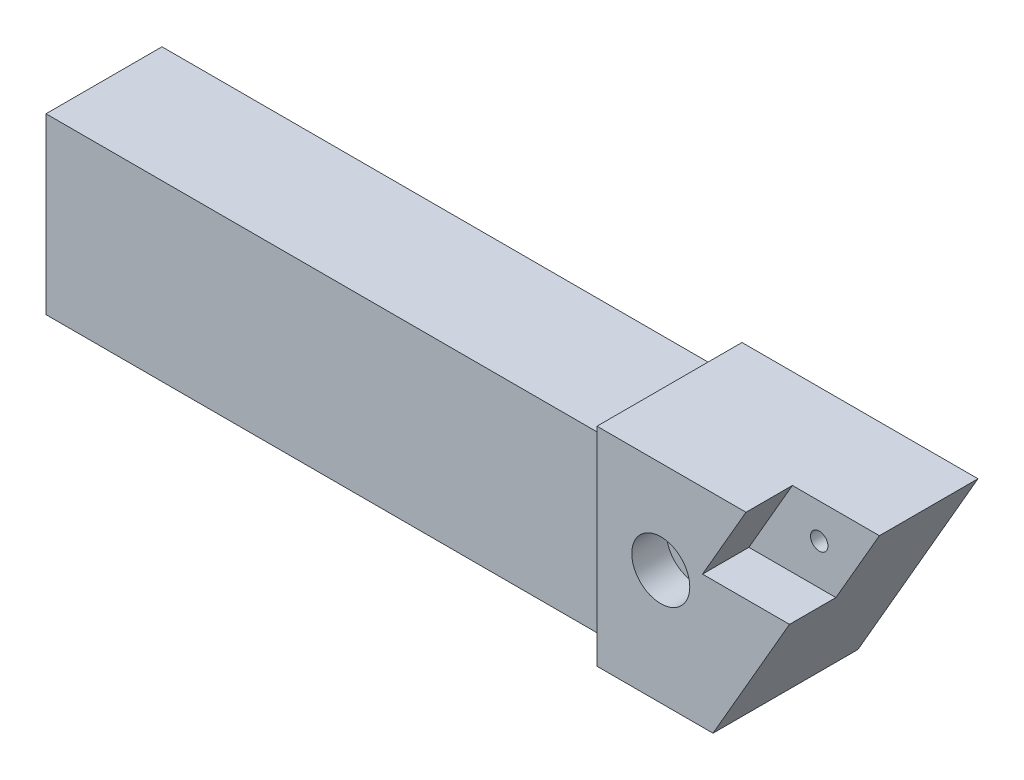
ISO-10303-21;
HEADER;
FILE_DESCRIPTION(('STEP AP214'),'2;1');
FILE_NAME('part.step','',(''),(''),'','','');
FILE_SCHEMA(('AUTOMOTIVE_DESIGN { 1 0 10303 214 1 1 1 1 }'));
ENDSEC;
DATA;
#1=APPLICATION_CONTEXT('core data for automotive mechanical design processes');
#2=APPLICATION_PROTOCOL_DEFINITION('international standard','automotive_design',2000,#1);
#3=PRODUCT_CONTEXT('',#1,'mechanical');
#4=PRODUCT('Part','Part','',(#3));
#5=PRODUCT_RELATED_PRODUCT_CATEGORY('part','',(#4));
#6=PRODUCT_DEFINITION_FORMATION('','',#4);
#7=PRODUCT_DEFINITION_CONTEXT('part definition',#1,'design');
#8=PRODUCT_DEFINITION('design','',#6,#7);
#9=PRODUCT_DEFINITION_SHAPE('','',#8);
#10=(LENGTH_UNIT() NAMED_UNIT(*) SI_UNIT(.MILLI.,.METRE.));
#11=(NAMED_UNIT(*) PLANE_ANGLE_UNIT() SI_UNIT($,.RADIAN.));
#12=(NAMED_UNIT(*) SI_UNIT($,.STERADIAN.) SOLID_ANGLE_UNIT());
#13=UNCERTAINTY_MEASURE_WITH_UNIT(LENGTH_MEASURE(1.E-05),#10,'distance_accuracy_value','');
#14=(GEOMETRIC_REPRESENTATION_CONTEXT(3) GLOBAL_UNCERTAINTY_ASSIGNED_CONTEXT((#13)) GLOBAL_UNIT_ASSIGNED_CONTEXT((#10,
#11,#12)) REPRESENTATION_CONTEXT('',''));
#15=CARTESIAN_POINT('',(0.,0.,0.));
#16=DIRECTION('',(0.,0.,1.));
#17=DIRECTION('',(1.,0.,0.));
#18=AXIS2_PLACEMENT_3D('',#15,#16,#17);
#19=CARTESIAN_POINT('',(-50.,15.,20.));
#20=DIRECTION('',(0.,-1.,0.));
#21=DIRECTION('',(0.,0.,-1.));
#22=AXIS2_PLACEMENT_3D('',#19,#20,#21);
#23=PLANE('',#22);
#24=DIRECTION('',(-1.,0.,0.));
#25=VECTOR('',#24,1.);
#26=CARTESIAN_POINT('',(-50.,15.,20.));
#27=LINE('',#26,#25);
#28=CARTESIAN_POINT('',(45.,15.,20.));
#29=VERTEX_POINT('',#28);
#30=CARTESIAN_POINT('',(-50.,15.,20.));
#31=VERTEX_POINT('',#30);
#32=EDGE_CURVE('E162',#29,#31,#27,.T.);
#33=ORIENTED_EDGE('',*,*,#32,.F.);
#34=DIRECTION('',(0.,0.,-1.));
#35=VECTOR('',#34,1.);
#36=CARTESIAN_POINT('',(45.,15.,20.));
#37=LINE('',#36,#35);
#38=CARTESIAN_POINT('',(45.,15.,0.));
#39=VERTEX_POINT('',#38);
#40=EDGE_CURVE('E186',#29,#39,#37,.T.);
#41=ORIENTED_EDGE('',*,*,#40,.T.);
#42=DIRECTION('',(-1.,0.,0.));
#43=VECTOR('',#42,1.);
#44=CARTESIAN_POINT('',(-50.,15.,0.));
#45=LINE('',#44,#43);
#46=CARTESIAN_POINT('',(-50.,15.,0.));
#47=VERTEX_POINT('',#46);
#48=EDGE_CURVE('E151',#39,#47,#45,.T.);
#49=ORIENTED_EDGE('',*,*,#48,.T.);
#50=DIRECTION('',(0.,0.,-1.));
#51=VECTOR('',#50,1.);
#52=CARTESIAN_POINT('',(-50.,15.,20.));
#53=LINE('',#52,#51);
#54=EDGE_CURVE('E189',#31,#47,#53,.T.);
#55=ORIENTED_EDGE('',*,*,#54,.F.);
#56=EDGE_LOOP('',(#33,#41,#49,#55));
#57=FACE_BOUND('',#56,.T.);
#58=ADVANCED_FACE('F36',(#57),#23,.F.);
#59=CARTESIAN_POINT('',(-50.,15.,20.));
#60=DIRECTION('',(1.,0.,0.));
#61=DIRECTION('',(0.,1.,0.));
#62=AXIS2_PLACEMENT_3D('',#59,#60,#61);
#63=PLANE('',#62);
#64=DIRECTION('',(0.,-1.,0.));
#65=VECTOR('',#64,1.);
#66=CARTESIAN_POINT('',(-50.,15.,0.));
#67=LINE('',#66,#65);
#68=CARTESIAN_POINT('',(-50.,-15.,0.));
#69=VERTEX_POINT('',#68);
#70=EDGE_CURVE('E194',#47,#69,#67,.T.);
#71=ORIENTED_EDGE('',*,*,#70,.T.);
#72=DIRECTION('',(0.,0.,-1.));
#73=VECTOR('',#72,1.);
#74=CARTESIAN_POINT('',(-50.,-15.,20.));
#75=LINE('',#74,#73);
#76=CARTESIAN_POINT('',(-50.,-15.,20.));
#77=VERTEX_POINT('',#76);
#78=EDGE_CURVE('E201',#77,#69,#75,.T.);
#79=ORIENTED_EDGE('',*,*,#78,.F.);
#80=DIRECTION('',(0.,-1.,0.));
#81=VECTOR('',#80,1.);
#82=CARTESIAN_POINT('',(-50.,15.,20.));
#83=LINE('',#82,#81);
#84=EDGE_CURVE('E202',#31,#77,#83,.T.);
#85=ORIENTED_EDGE('',*,*,#84,.F.);
#86=ORIENTED_EDGE('',*,*,#54,.T.);
#87=EDGE_LOOP('',(#71,#79,#85,#86));
#88=FACE_BOUND('',#87,.T.);
#89=ADVANCED_FACE('F219',(#88),#63,.F.);
#90=CARTESIAN_POINT('',(-50.,-15.,20.));
#91=DIRECTION('',(0.,1.,0.));
#92=DIRECTION('',(0.,0.,1.));
#93=AXIS2_PLACEMENT_3D('',#90,#91,#92);
#94=PLANE('',#93);
#95=DIRECTION('',(1.,0.,0.));
#96=VECTOR('',#95,1.);
#97=CARTESIAN_POINT('',(-50.,-15.,0.));
#98=LINE('',#97,#96);
#99=CARTESIAN_POINT('',(70.,-15.,0.));
#100=VERTEX_POINT('',#99);
#101=EDGE_CURVE('E207',#69,#100,#98,.T.);
#102=ORIENTED_EDGE('',*,*,#101,.T.);
#103=DIRECTION('',(0.,0.,1.));
#104=VECTOR('',#103,1.);
#105=CARTESIAN_POINT('',(70.,-15.,0.));
#106=LINE('',#105,#104);
#107=CARTESIAN_POINT('',(70.,-15.,25.));
#108=VERTEX_POINT('',#107);
#109=EDGE_CURVE('E148',#100,#108,#106,.T.);
#110=ORIENTED_EDGE('',*,*,#109,.T.);
#111=DIRECTION('',(1.,0.,0.));
#112=VECTOR('',#111,1.);
#113=CARTESIAN_POINT('',(50.,-15.,25.));
#114=LINE('',#113,#112);
#115=CARTESIAN_POINT('',(50.,-15.,25.));
#116=VERTEX_POINT('',#115);
#117=EDGE_CURVE('E231',#116,#108,#114,.T.);
#118=ORIENTED_EDGE('',*,*,#117,.F.);
#119=CARTESIAN_POINT('',(45.,-15.,25.));
#120=DIRECTION('',(0.,1.,0.));
#121=DIRECTION('',(0.,0.,1.));
#122=AXIS2_PLACEMENT_3D('',#119,#120,#121);
#123=CIRCLE('',#122,5.);
#124=CARTESIAN_POINT('',(45.,-15.,20.));
#125=VERTEX_POINT('',#124);
#126=EDGE_CURVE('E11',#116,#125,#123,.T.);
#127=ORIENTED_EDGE('',*,*,#126,.T.);
#128=DIRECTION('',(1.,0.,0.));
#129=VECTOR('',#128,1.);
#130=CARTESIAN_POINT('',(-50.,-15.,20.));
#131=LINE('',#130,#129);
#132=EDGE_CURVE('E199',#77,#125,#131,.T.);
#133=ORIENTED_EDGE('',*,*,#132,.F.);
#134=ORIENTED_EDGE('',*,*,#78,.T.);
#135=EDGE_LOOP('',(#102,#110,#118,#127,#133,#134));
#136=FACE_BOUND('',#135,.T.);
#137=ADVANCED_FACE('F220',(#136),#94,.F.);
#138=CARTESIAN_POINT('',(0.,0.,20.));
#139=DIRECTION('',(0.,0.,1.));
#140=DIRECTION('',(1.,0.,0.));
#141=AXIS2_PLACEMENT_3D('',#138,#139,#140);
#142=PLANE('',#141);
#143=ORIENTED_EDGE('',*,*,#132,.T.);
#144=DIRECTION('',(0.,1.,0.));
#145=VECTOR('',#144,1.);
#146=CARTESIAN_POINT('',(45.,15.,20.));
#147=LINE('',#146,#145);
#148=EDGE_CURVE('E185',#125,#29,#147,.T.);
#149=ORIENTED_EDGE('',*,*,#148,.T.);
#150=ORIENTED_EDGE('',*,*,#32,.T.);
#151=ORIENTED_EDGE('',*,*,#84,.T.);
#152=EDGE_LOOP('',(#143,#149,#150,#151));
#153=FACE_BOUND('',#152,.T.);
#154=ADVANCED_FACE('F214',(#153),#142,.T.);
#155=CARTESIAN_POINT('',(0.,0.,0.));
#156=DIRECTION('',(0.,0.,1.));
#157=DIRECTION('',(1.,0.,0.));
#158=AXIS2_PLACEMENT_3D('',#155,#156,#157);
#159=PLANE('',#158);
#160=CARTESIAN_POINT('',(61.,4.84504138230249,0.));
#161=DIRECTION('',(0.,0.,1.));
#162=DIRECTION('',(1.,0.,0.));
#163=AXIS2_PLACEMENT_3D('',#160,#161,#162);
#164=CIRCLE('',#163,2.50000000000002);
#165=CARTESIAN_POINT('',(63.5,4.84504138230249,0.));
#166=VERTEX_POINT('',#165);
#167=EDGE_CURVE('E249',#166,#166,#164,.T.);
#168=ORIENTED_EDGE('',*,*,#167,.T.);
#169=EDGE_LOOP('',(#168));
#170=FACE_BOUND('',#169,.T.);
#171=CARTESIAN_POINT('',(80.3194999441682,14.854660325536,0.));
#172=DIRECTION('',(0.,0.,1.));
#173=DIRECTION('',(1.,0.,0.));
#174=AXIS2_PLACEMENT_3D('',#171,#172,#173);
#175=CIRCLE('',#174,1.5);
#176=CARTESIAN_POINT('',(81.8194999441682,14.854660325536,0.));
#177=VERTEX_POINT('',#176);
#178=EDGE_CURVE('E243',#177,#177,#175,.T.);
#179=ORIENTED_EDGE('',*,*,#178,.T.);
#180=EDGE_LOOP('',(#179));
#181=FACE_BOUND('',#180,.T.);
#182=ORIENTED_EDGE('',*,*,#48,.F.);
#183=CARTESIAN_POINT('',(45.,20.,0.));
#184=DIRECTION('',(0.,0.,1.));
#185=DIRECTION('',(1.,0.,0.));
#186=AXIS2_PLACEMENT_3D('',#183,#184,#185);
#187=CIRCLE('',#186,5.);
#188=CARTESIAN_POINT('',(50.,20.,0.));
#189=VERTEX_POINT('',#188);
#190=EDGE_CURVE('E45',#39,#189,#187,.T.);
#191=ORIENTED_EDGE('',*,*,#190,.T.);
#192=DIRECTION('',(0.,-1.,0.));
#193=VECTOR('',#192,1.);
#194=CARTESIAN_POINT('',(50.,20.8450413823025,0.));
#195=LINE('',#194,#193);
#196=CARTESIAN_POINT('',(50.,20.8450413823025,0.));
#197=VERTEX_POINT('',#196);
#198=EDGE_CURVE('E157',#197,#189,#195,.T.);
#199=ORIENTED_EDGE('',*,*,#198,.F.);
#200=DIRECTION('',(-1.,0.,0.));
#201=VECTOR('',#200,1.);
#202=CARTESIAN_POINT('',(90.6951442911858,20.8450413823025,0.));
#203=LINE('',#202,#201);
#204=CARTESIAN_POINT('',(90.6951442911858,20.8450413823025,0.));
#205=VERTEX_POINT('',#204);
#206=EDGE_CURVE('E153',#205,#197,#203,.T.);
#207=ORIENTED_EDGE('',*,*,#206,.F.);
#208=DIRECTION('',(0.500000000000004,0.866025403784436,0.));
#209=VECTOR('',#208,1.);
#210=CARTESIAN_POINT('',(70.,-15.,0.));
#211=LINE('',#210,#209);
#212=EDGE_CURVE('E145',#100,#205,#211,.T.);
#213=ORIENTED_EDGE('',*,*,#212,.F.);
#214=ORIENTED_EDGE('',*,*,#101,.F.);
#215=ORIENTED_EDGE('',*,*,#70,.F.);
#216=EDGE_LOOP('',(#182,#191,#199,#207,#213,#214,#215));
#217=FACE_BOUND('',#216,.T.);
#218=ADVANCED_FACE('F172',(#170,#181,#217),#159,.F.);
#219=CARTESIAN_POINT('',(50.,20.8450413823025,0.));
#220=DIRECTION('',(-1.,0.,0.));
#221=DIRECTION('',(0.,0.,1.));
#222=AXIS2_PLACEMENT_3D('',#219,#220,#221);
#223=PLANE('',#222);
#224=ORIENTED_EDGE('',*,*,#198,.T.);
#225=DIRECTION('',(0.,0.,-1.));
#226=VECTOR('',#225,1.);
#227=CARTESIAN_POINT('',(50.,20.,0.));
#228=LINE('',#227,#226);
#229=CARTESIAN_POINT('',(50.,20.,25.));
#230=VERTEX_POINT('',#229);
#231=EDGE_CURVE('E177',#189,#230,#228,.F.);
#232=ORIENTED_EDGE('',*,*,#231,.T.);
#233=DIRECTION('',(0.,-1.,0.));
#234=VECTOR('',#233,1.);
#235=CARTESIAN_POINT('',(50.,20.8450413823025,25.));
#236=LINE('',#235,#234);
#237=CARTESIAN_POINT('',(50.,20.8450413823025,25.));
#238=VERTEX_POINT('',#237);
#239=EDGE_CURVE('E232',#238,#230,#236,.T.);
#240=ORIENTED_EDGE('',*,*,#239,.F.);
#241=DIRECTION('',(0.,0.,1.));
#242=VECTOR('',#241,1.);
#243=CARTESIAN_POINT('',(50.,20.8450413823025,0.));
#244=LINE('',#243,#242);
#245=EDGE_CURVE('E147',#197,#238,#244,.T.);
#246=ORIENTED_EDGE('',*,*,#245,.F.);
#247=EDGE_LOOP('',(#224,#232,#240,#246));
#248=FACE_BOUND('',#247,.T.);
#249=ADVANCED_FACE('F176',(#248),#223,.T.);
#250=CARTESIAN_POINT('',(90.6951442911858,20.8450413823025,0.));
#251=DIRECTION('',(0.,1.,0.));
#252=DIRECTION('',(-1.,0.,0.));
#253=AXIS2_PLACEMENT_3D('',#250,#251,#252);
#254=PLANE('',#253);
#255=DIRECTION('',(0.,0.,1.));
#256=VECTOR('',#255,1.);
#257=CARTESIAN_POINT('',(75.6951442911858,20.8450413823025,17.));
#258=LINE('',#257,#256);
#259=CARTESIAN_POINT('',(75.6951442911858,20.8450413823025,17.));
#260=VERTEX_POINT('',#259);
#261=CARTESIAN_POINT('',(75.6951442911858,20.8450413823025,25.));
#262=VERTEX_POINT('',#261);
#263=EDGE_CURVE('E52',#260,#262,#258,.T.);
#264=ORIENTED_EDGE('',*,*,#263,.F.);
#265=DIRECTION('',(-1.,0.,0.));
#266=VECTOR('',#265,1.);
#267=CARTESIAN_POINT('',(75.6951442911858,20.8450413823025,17.));
#268=LINE('',#267,#266);
#269=CARTESIAN_POINT('',(90.6951442911858,20.8450413823025,17.));
#270=VERTEX_POINT('',#269);
#271=EDGE_CURVE('E126',#270,#260,#268,.T.);
#272=ORIENTED_EDGE('',*,*,#271,.F.);
#273=DIRECTION('',(0.,0.,1.));
#274=VECTOR('',#273,1.);
#275=CARTESIAN_POINT('',(90.6951442911858,20.8450413823025,0.));
#276=LINE('',#275,#274);
#277=EDGE_CURVE('E137',#205,#270,#276,.T.);
#278=ORIENTED_EDGE('',*,*,#277,.F.);
#279=ORIENTED_EDGE('',*,*,#206,.T.);
#280=ORIENTED_EDGE('',*,*,#245,.T.);
#281=DIRECTION('',(-1.,0.,0.));
#282=VECTOR('',#281,1.);
#283=CARTESIAN_POINT('',(90.6951442911858,20.8450413823025,25.));
#284=LINE('',#283,#282);
#285=EDGE_CURVE('E161',#262,#238,#284,.T.);
#286=ORIENTED_EDGE('',*,*,#285,.F.);
#287=EDGE_LOOP('',(#264,#272,#278,#279,#280,#286));
#288=FACE_BOUND('',#287,.T.);
#289=ADVANCED_FACE('F135',(#288),#254,.T.);
#290=CARTESIAN_POINT('',(70.,-15.,0.));
#291=DIRECTION('',(0.866025403784436,-0.500000000000004,0.));
#292=DIRECTION('',(0.500000000000004,0.866025403784437,0.));
#293=AXIS2_PLACEMENT_3D('',#290,#291,#292);
#294=PLANE('',#293);
#295=DIRECTION('',(0.,0.,1.));
#296=VECTOR('',#295,1.);
#297=CARTESIAN_POINT('',(83.1951442911857,7.85466032553601,17.));
#298=LINE('',#297,#296);
#299=CARTESIAN_POINT('',(83.1951442911857,7.85466032553601,17.));
#300=VERTEX_POINT('',#299);
#301=CARTESIAN_POINT('',(83.1951442911857,7.85466032553601,25.));
#302=VERTEX_POINT('',#301);
#303=EDGE_CURVE('E224',#300,#302,#298,.T.);
#304=ORIENTED_EDGE('',*,*,#303,.T.);
#305=DIRECTION('',(0.500000000000004,0.866025403784436,0.));
#306=VECTOR('',#305,1.);
#307=CARTESIAN_POINT('',(70.,-15.,25.));
#308=LINE('',#307,#306);
#309=EDGE_CURVE('E228',#108,#302,#308,.T.);
#310=ORIENTED_EDGE('',*,*,#309,.F.);
#311=ORIENTED_EDGE('',*,*,#109,.F.);
#312=ORIENTED_EDGE('',*,*,#212,.T.);
#313=ORIENTED_EDGE('',*,*,#277,.T.);
#314=DIRECTION('',(0.500000000000009,0.866025403784433,0.));
#315=VECTOR('',#314,1.);
#316=CARTESIAN_POINT('',(90.6951442911858,20.8450413823025,17.));
#317=LINE('',#316,#315);
#318=EDGE_CURVE('E122',#300,#270,#317,.T.);
#319=ORIENTED_EDGE('',*,*,#318,.F.);
#320=EDGE_LOOP('',(#304,#310,#311,#312,#313,#319));
#321=FACE_BOUND('',#320,.T.);
#322=ADVANCED_FACE('F142',(#321),#294,.T.);
#323=CARTESIAN_POINT('',(0.,0.,25.));
#324=DIRECTION('',(0.,0.,1.));
#325=DIRECTION('',(1.,0.,0.));
#326=AXIS2_PLACEMENT_3D('',#323,#324,#325);
#327=PLANE('',#326);
#328=CARTESIAN_POINT('',(61.,4.84504138230249,25.));
#329=DIRECTION('',(0.,0.,1.));
#330=DIRECTION('',(1.,0.,0.));
#331=AXIS2_PLACEMENT_3D('',#328,#329,#330);
#332=CIRCLE('',#331,5.00000000000002);
#333=CARTESIAN_POINT('',(66.,4.84504138230249,25.));
#334=VERTEX_POINT('',#333);
#335=EDGE_CURVE('E260',#334,#334,#332,.T.);
#336=ORIENTED_EDGE('',*,*,#335,.F.);
#337=EDGE_LOOP('',(#336));
#338=FACE_BOUND('',#337,.T.);
#339=DIRECTION('',(1.,0.,0.));
#340=VECTOR('',#339,1.);
#341=CARTESIAN_POINT('',(68.195144291186,7.85466032553601,25.));
#342=LINE('',#341,#340);
#343=CARTESIAN_POINT('',(68.195144291186,7.85466032553601,25.));
#344=VERTEX_POINT('',#343);
#345=EDGE_CURVE('E132',#344,#302,#342,.T.);
#346=ORIENTED_EDGE('',*,*,#345,.F.);
#347=DIRECTION('',(-0.499999999999992,-0.866025403784444,0.));
#348=VECTOR('',#347,1.);
#349=CARTESIAN_POINT('',(75.6951442911858,20.8450413823025,25.));
#350=LINE('',#349,#348);
#351=EDGE_CURVE('E241',#262,#344,#350,.T.);
#352=ORIENTED_EDGE('',*,*,#351,.F.);
#353=ORIENTED_EDGE('',*,*,#285,.T.);
#354=ORIENTED_EDGE('',*,*,#239,.T.);
#355=EDGE_CURVE('E223',#230,#116,#236,.T.);
#356=ORIENTED_EDGE('',*,*,#355,.T.);
#357=ORIENTED_EDGE('',*,*,#117,.T.);
#358=ORIENTED_EDGE('',*,*,#309,.T.);
#359=EDGE_LOOP('',(#346,#352,#353,#354,#356,#357,#358));
#360=FACE_BOUND('',#359,.T.);
#361=ADVANCED_FACE('F266',(#338,#360),#327,.T.);
#362=CARTESIAN_POINT('',(45.,0.,25.));
#363=DIRECTION('',(0.,-1.,0.));
#364=DIRECTION('',(0.,0.,-1.));
#365=AXIS2_PLACEMENT_3D('',#362,#363,#364);
#366=CYLINDRICAL_SURFACE('',#365,5.);
#367=ORIENTED_EDGE('',*,*,#126,.F.);
#368=ORIENTED_EDGE('',*,*,#355,.F.);
#369=CARTESIAN_POINT('',(45.,20.,25.));
#370=DIRECTION('',(0.,-0.707106781186547,0.707106781186547));
#371=DIRECTION('',(0.,-0.707106781186547,-0.707106781186547));
#372=AXIS2_PLACEMENT_3D('',#369,#370,#371);
#373=ELLIPSE('',#372,7.07106781186547,5.);
#374=EDGE_CURVE('E40',#29,#230,#373,.T.);
#375=ORIENTED_EDGE('',*,*,#374,.F.);
#376=ORIENTED_EDGE('',*,*,#148,.F.);
#377=EDGE_LOOP('',(#367,#368,#375,#376));
#378=FACE_BOUND('',#377,.T.);
#379=ADVANCED_FACE('F38',(#378),#366,.F.);
#380=CARTESIAN_POINT('',(45.,20.,20.));
#381=DIRECTION('',(0.,0.,-1.));
#382=DIRECTION('',(-1.,0.,0.));
#383=AXIS2_PLACEMENT_3D('',#380,#381,#382);
#384=CYLINDRICAL_SURFACE('',#383,5.);
#385=ORIENTED_EDGE('',*,*,#374,.T.);
#386=ORIENTED_EDGE('',*,*,#231,.F.);
#387=ORIENTED_EDGE('',*,*,#190,.F.);
#388=ORIENTED_EDGE('',*,*,#40,.F.);
#389=EDGE_LOOP('',(#385,#386,#387,#388));
#390=FACE_BOUND('',#389,.T.);
#391=ADVANCED_FACE('F181',(#390),#384,.F.);
#392=CARTESIAN_POINT('',(68.195144291186,7.85466032553601,17.));
#393=DIRECTION('',(0.,-1.,0.));
#394=DIRECTION('',(0.,0.,-1.));
#395=AXIS2_PLACEMENT_3D('',#392,#393,#394);
#396=PLANE('',#395);
#397=ORIENTED_EDGE('',*,*,#345,.T.);
#398=ORIENTED_EDGE('',*,*,#303,.F.);
#399=DIRECTION('',(1.,0.,0.));
#400=VECTOR('',#399,1.);
#401=CARTESIAN_POINT('',(68.195144291186,7.85466032553601,17.));
#402=LINE('',#401,#400);
#403=CARTESIAN_POINT('',(68.195144291186,7.85466032553601,17.));
#404=VERTEX_POINT('',#403);
#405=EDGE_CURVE('E128',#404,#300,#402,.T.);
#406=ORIENTED_EDGE('',*,*,#405,.F.);
#407=DIRECTION('',(0.,0.,1.));
#408=VECTOR('',#407,1.);
#409=CARTESIAN_POINT('',(68.195144291186,7.85466032553601,17.));
#410=LINE('',#409,#408);
#411=EDGE_CURVE('E237',#404,#344,#410,.T.);
#412=ORIENTED_EDGE('',*,*,#411,.T.);
#413=EDGE_LOOP('',(#397,#398,#406,#412));
#414=FACE_BOUND('',#413,.T.);
#415=ADVANCED_FACE('F270',(#414),#396,.F.);
#416=CARTESIAN_POINT('',(75.6951442911858,20.8450413823025,17.));
#417=DIRECTION('',(-0.866025403784444,0.499999999999992,0.));
#418=DIRECTION('',(-0.499999999999992,-0.866025403784444,0.));
#419=AXIS2_PLACEMENT_3D('',#416,#417,#418);
#420=PLANE('',#419);
#421=ORIENTED_EDGE('',*,*,#351,.T.);
#422=ORIENTED_EDGE('',*,*,#411,.F.);
#423=DIRECTION('',(-0.499999999999992,-0.866025403784444,0.));
#424=VECTOR('',#423,1.);
#425=CARTESIAN_POINT('',(75.6951442911858,20.8450413823025,17.));
#426=LINE('',#425,#424);
#427=EDGE_CURVE('E140',#260,#404,#426,.T.);
#428=ORIENTED_EDGE('',*,*,#427,.F.);
#429=ORIENTED_EDGE('',*,*,#263,.T.);
#430=EDGE_LOOP('',(#421,#422,#428,#429));
#431=FACE_BOUND('',#430,.T.);
#432=ADVANCED_FACE('F271',(#431),#420,.F.);
#433=CARTESIAN_POINT('',(0.,0.,17.));
#434=DIRECTION('',(0.,0.,1.));
#435=DIRECTION('',(1.,0.,0.));
#436=AXIS2_PLACEMENT_3D('',#433,#434,#435);
#437=PLANE('',#436);
#438=CARTESIAN_POINT('',(80.3194999441682,14.854660325536,17.));
#439=DIRECTION('',(0.,0.,1.));
#440=DIRECTION('',(1.,0.,0.));
#441=AXIS2_PLACEMENT_3D('',#438,#439,#440);
#442=CIRCLE('',#441,1.5);
#443=CARTESIAN_POINT('',(81.8194999441682,14.854660325536,17.));
#444=VERTEX_POINT('',#443);
#445=EDGE_CURVE('E246',#444,#444,#442,.T.);
#446=ORIENTED_EDGE('',*,*,#445,.F.);
#447=EDGE_LOOP('',(#446));
#448=FACE_BOUND('',#447,.T.);
#449=ORIENTED_EDGE('',*,*,#318,.T.);
#450=ORIENTED_EDGE('',*,*,#271,.T.);
#451=ORIENTED_EDGE('',*,*,#427,.T.);
#452=ORIENTED_EDGE('',*,*,#405,.T.);
#453=EDGE_LOOP('',(#449,#450,#451,#452));
#454=FACE_BOUND('',#453,.T.);
#455=ADVANCED_FACE('F124',(#448,#454),#437,.T.);
#456=CARTESIAN_POINT('',(80.3194999441682,14.854660325536,0.));
#457=DIRECTION('',(0.,0.,1.));
#458=DIRECTION('',(1.,0.,0.));
#459=AXIS2_PLACEMENT_3D('',#456,#457,#458);
#460=CYLINDRICAL_SURFACE('',#459,1.5);
#461=ORIENTED_EDGE('',*,*,#178,.F.);
#462=EDGE_LOOP('',(#461));
#463=FACE_BOUND('',#462,.T.);
#464=ORIENTED_EDGE('',*,*,#445,.T.);
#465=EDGE_LOOP('',(#464));
#466=FACE_BOUND('',#465,.T.);
#467=ADVANCED_FACE('F278',(#463,#466),#460,.F.);
#468=CARTESIAN_POINT('',(61.,4.84504138230249,25.));
#469=DIRECTION('',(0.,0.,1.));
#470=DIRECTION('',(1.,0.,0.));
#471=AXIS2_PLACEMENT_3D('',#468,#469,#470);
#472=CYLINDRICAL_SURFACE('',#471,2.50000000000002);
#473=ORIENTED_EDGE('',*,*,#167,.F.);
#474=EDGE_LOOP('',(#473));
#475=FACE_BOUND('',#474,.T.);
#476=CARTESIAN_POINT('',(61.,4.84504138230249,19.));
#477=DIRECTION('',(0.,0.,1.));
#478=DIRECTION('',(1.,0.,0.));
#479=AXIS2_PLACEMENT_3D('',#476,#477,#478);
#480=CIRCLE('',#479,2.50000000000002);
#481=CARTESIAN_POINT('',(63.5,4.84504138230249,19.));
#482=VERTEX_POINT('',#481);
#483=EDGE_CURVE('E254',#482,#482,#480,.T.);
#484=ORIENTED_EDGE('',*,*,#483,.T.);
#485=EDGE_LOOP('',(#484));
#486=FACE_BOUND('',#485,.T.);
#487=ADVANCED_FACE('F394',(#475,#486),#472,.F.);
#488=CARTESIAN_POINT('',(63.5,4.84504138230249,19.));
#489=DIRECTION('',(0.,0.,-1.));
#490=DIRECTION('',(-1.,0.,0.));
#491=AXIS2_PLACEMENT_3D('',#488,#489,#490);
#492=PLANE('',#491);
#493=ORIENTED_EDGE('',*,*,#483,.F.);
#494=EDGE_LOOP('',(#493));
#495=FACE_BOUND('',#494,.T.);
#496=CARTESIAN_POINT('',(61.,4.84504138230249,19.));
#497=DIRECTION('',(0.,0.,1.));
#498=DIRECTION('',(1.,0.,0.));
#499=AXIS2_PLACEMENT_3D('',#496,#497,#498);
#500=CIRCLE('',#499,5.00000000000002);
#501=CARTESIAN_POINT('',(66.,4.84504138230249,19.));
#502=VERTEX_POINT('',#501);
#503=EDGE_CURVE('E257',#502,#502,#500,.T.);
#504=ORIENTED_EDGE('',*,*,#503,.T.);
#505=EDGE_LOOP('',(#504));
#506=FACE_BOUND('',#505,.T.);
#507=ADVANCED_FACE('F403',(#495,#506),#492,.F.);
#508=CARTESIAN_POINT('',(61.,4.84504138230249,25.));
#509=DIRECTION('',(0.,0.,1.));
#510=DIRECTION('',(1.,0.,0.));
#511=AXIS2_PLACEMENT_3D('',#508,#509,#510);
#512=CYLINDRICAL_SURFACE('',#511,5.00000000000002);
#513=ORIENTED_EDGE('',*,*,#503,.F.);
#514=EDGE_LOOP('',(#513));
#515=FACE_BOUND('',#514,.T.);
#516=ORIENTED_EDGE('',*,*,#335,.T.);
#517=EDGE_LOOP('',(#516));
#518=FACE_BOUND('',#517,.T.);
#519=ADVANCED_FACE('F264',(#515,#518),#512,.F.);
#520=CLOSED_SHELL('',(#58,#89,#137,#154,#218,#249,#289,#322,#361,#379,#391,#415,#432,#455,#467,
#487,#507,#519));
#521=MANIFOLD_SOLID_BREP('B2',#520);
#522=ADVANCED_BREP_SHAPE_REPRESENTATION('',(#18,#521),#14);
#523=SHAPE_DEFINITION_REPRESENTATION(#9,#522);
ENDSEC;
END-ISO-10303-21;
